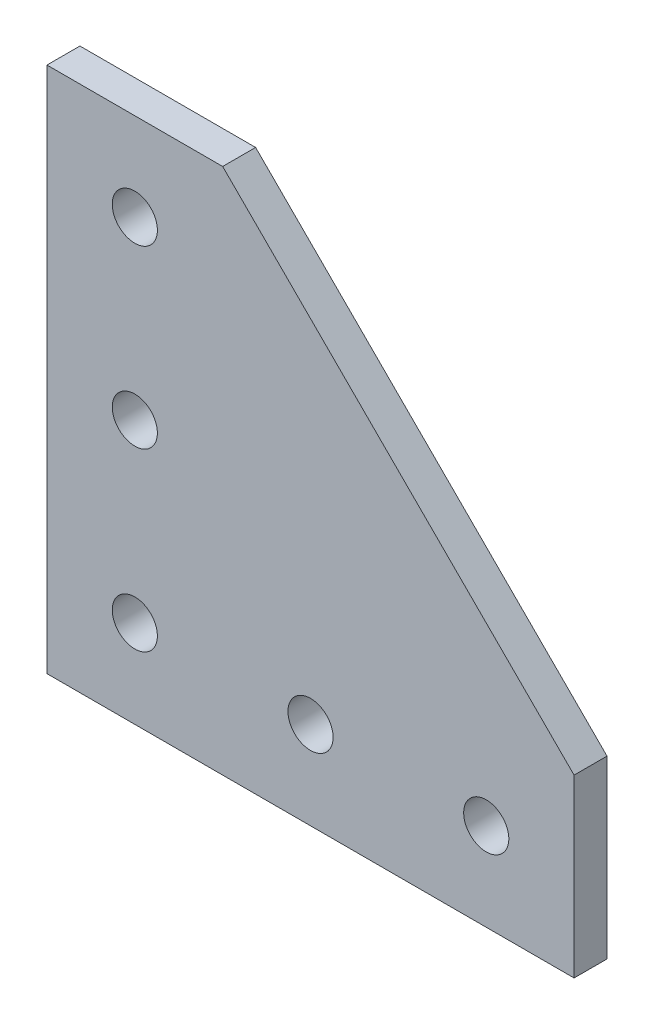
ISO-10303-21;
HEADER;
FILE_DESCRIPTION(('STEP AP214'),'2;1');
FILE_NAME('part.step','',(''),(''),'','','');
FILE_SCHEMA(('AUTOMOTIVE_DESIGN { 1 0 10303 214 1 1 1 1 }'));
ENDSEC;
DATA;
#1=APPLICATION_CONTEXT('core data for automotive mechanical design processes');
#2=APPLICATION_PROTOCOL_DEFINITION('international standard','automotive_design',2000,#1);
#3=PRODUCT_CONTEXT('',#1,'mechanical');
#4=PRODUCT('Part','Part','',(#3));
#5=PRODUCT_RELATED_PRODUCT_CATEGORY('part','',(#4));
#6=PRODUCT_DEFINITION_FORMATION('','',#4);
#7=PRODUCT_DEFINITION_CONTEXT('part definition',#1,'design');
#8=PRODUCT_DEFINITION('design','',#6,#7);
#9=PRODUCT_DEFINITION_SHAPE('','',#8);
#10=(LENGTH_UNIT() NAMED_UNIT(*) SI_UNIT(.MILLI.,.METRE.));
#11=(NAMED_UNIT(*) PLANE_ANGLE_UNIT() SI_UNIT($,.RADIAN.));
#12=(NAMED_UNIT(*) SI_UNIT($,.STERADIAN.) SOLID_ANGLE_UNIT());
#13=UNCERTAINTY_MEASURE_WITH_UNIT(LENGTH_MEASURE(1.E-05),#10,'distance_accuracy_value','');
#14=(GEOMETRIC_REPRESENTATION_CONTEXT(3) GLOBAL_UNCERTAINTY_ASSIGNED_CONTEXT((#13)) GLOBAL_UNIT_ASSIGNED_CONTEXT((#10,
#11,#12)) REPRESENTATION_CONTEXT('',''));
#15=CARTESIAN_POINT('',(0.,0.,0.));
#16=DIRECTION('',(0.,0.,1.));
#17=DIRECTION('',(1.,0.,0.));
#18=AXIS2_PLACEMENT_3D('',#15,#16,#17);
#19=CARTESIAN_POINT('',(0.,0.,-2.38125));
#20=DIRECTION('',(0.,0.,-1.));
#21=DIRECTION('',(-1.,0.,0.));
#22=AXIS2_PLACEMENT_3D('',#19,#20,#21);
#23=PLANE('',#22);
#24=CARTESIAN_POINT('',(12.7,38.1,-2.38125));
#25=DIRECTION('',(0.,0.,-1.));
#26=DIRECTION('',(-1.,0.,0.));
#27=AXIS2_PLACEMENT_3D('',#24,#25,#26);
#28=CIRCLE('',#27,3.26389999999999);
#29=CARTESIAN_POINT('',(9.43610000000001,38.1,-2.38125));
#30=VERTEX_POINT('',#29);
#31=EDGE_CURVE('E124',#30,#30,#28,.F.);
#32=ORIENTED_EDGE('',*,*,#31,.T.);
#33=EDGE_LOOP('',(#32));
#34=FACE_BOUND('',#33,.T.);
#35=CARTESIAN_POINT('',(63.5,12.7,-2.38125));
#36=DIRECTION('',(0.,0.,-1.));
#37=DIRECTION('',(-1.,0.,0.));
#38=AXIS2_PLACEMENT_3D('',#35,#36,#37);
#39=CIRCLE('',#38,3.26389999999999);
#40=CARTESIAN_POINT('',(60.2361,12.7,-2.38125));
#41=VERTEX_POINT('',#40);
#42=EDGE_CURVE('E128',#41,#41,#39,.F.);
#43=ORIENTED_EDGE('',*,*,#42,.T.);
#44=EDGE_LOOP('',(#43));
#45=FACE_BOUND('',#44,.T.);
#46=CARTESIAN_POINT('',(12.7,12.7,-2.38125));
#47=DIRECTION('',(0.,0.,-1.));
#48=DIRECTION('',(-1.,0.,0.));
#49=AXIS2_PLACEMENT_3D('',#46,#47,#48);
#50=CIRCLE('',#49,3.2639);
#51=CARTESIAN_POINT('',(9.4361,12.7,-2.38125));
#52=VERTEX_POINT('',#51);
#53=EDGE_CURVE('E132',#52,#52,#50,.F.);
#54=ORIENTED_EDGE('',*,*,#53,.T.);
#55=EDGE_LOOP('',(#54));
#56=FACE_BOUND('',#55,.T.);
#57=DIRECTION('',(0.707106781186548,-0.707106781186548,0.));
#58=VECTOR('',#57,1.);
#59=CARTESIAN_POINT('',(76.2,25.4,-2.38125));
#60=LINE('',#59,#58);
#61=CARTESIAN_POINT('',(25.4,76.2,-2.38125));
#62=VERTEX_POINT('',#61);
#63=CARTESIAN_POINT('',(76.2,25.4,-2.38125));
#64=VERTEX_POINT('',#63);
#65=EDGE_CURVE('E341',#62,#64,#60,.T.);
#66=ORIENTED_EDGE('',*,*,#65,.T.);
#67=DIRECTION('',(0.,1.,0.));
#68=VECTOR('',#67,1.);
#69=CARTESIAN_POINT('',(76.2,25.4,-2.38125));
#70=LINE('',#69,#68);
#71=CARTESIAN_POINT('',(76.2,0.,-2.38125));
#72=VERTEX_POINT('',#71);
#73=EDGE_CURVE('E336',#64,#72,#70,.F.);
#74=ORIENTED_EDGE('',*,*,#73,.T.);
#75=DIRECTION('',(-1.,0.,0.));
#76=VECTOR('',#75,1.);
#77=CARTESIAN_POINT('',(76.2,0.,-2.38125));
#78=LINE('',#77,#76);
#79=CARTESIAN_POINT('',(0.,0.,-2.38125));
#80=VERTEX_POINT('',#79);
#81=EDGE_CURVE('E80',#72,#80,#78,.T.);
#82=ORIENTED_EDGE('',*,*,#81,.T.);
#83=DIRECTION('',(0.,1.,0.));
#84=VECTOR('',#83,1.);
#85=CARTESIAN_POINT('',(0.,0.,-2.38125));
#86=LINE('',#85,#84);
#87=CARTESIAN_POINT('',(0.,76.2,-2.38125));
#88=VERTEX_POINT('',#87);
#89=EDGE_CURVE('E78',#80,#88,#86,.T.);
#90=ORIENTED_EDGE('',*,*,#89,.T.);
#91=DIRECTION('',(1.,0.,0.));
#92=VECTOR('',#91,1.);
#93=CARTESIAN_POINT('',(0.,76.2,-2.38125));
#94=LINE('',#93,#92);
#95=EDGE_CURVE('E75',#88,#62,#94,.T.);
#96=ORIENTED_EDGE('',*,*,#95,.T.);
#97=EDGE_LOOP('',(#66,#74,#82,#90,#96));
#98=FACE_BOUND('',#97,.T.);
#99=CARTESIAN_POINT('',(38.1,12.7,-2.38125));
#100=DIRECTION('',(0.,0.,-1.));
#101=DIRECTION('',(-1.,0.,0.));
#102=AXIS2_PLACEMENT_3D('',#99,#100,#101);
#103=CIRCLE('',#102,3.26389999999999);
#104=CARTESIAN_POINT('',(34.8361,12.7,-2.38125));
#105=VERTEX_POINT('',#104);
#106=EDGE_CURVE('E87',#105,#105,#103,.F.);
#107=ORIENTED_EDGE('',*,*,#106,.T.);
#108=EDGE_LOOP('',(#107));
#109=FACE_BOUND('',#108,.T.);
#110=CARTESIAN_POINT('',(12.7,63.5,-2.38125));
#111=DIRECTION('',(0.,0.,-1.));
#112=DIRECTION('',(-1.,0.,0.));
#113=AXIS2_PLACEMENT_3D('',#110,#111,#112);
#114=CIRCLE('',#113,3.2639);
#115=CARTESIAN_POINT('',(9.4361,63.5,-2.38125));
#116=VERTEX_POINT('',#115);
#117=EDGE_CURVE('E21',#116,#116,#114,.F.);
#118=ORIENTED_EDGE('',*,*,#117,.T.);
#119=EDGE_LOOP('',(#118));
#120=FACE_BOUND('',#119,.T.);
#121=ADVANCED_FACE('F18',(#34,#45,#56,#98,#109,#120),#23,.T.);
#122=CARTESIAN_POINT('',(12.7,63.5,2.38125));
#123=DIRECTION('',(0.,0.,-1.));
#124=DIRECTION('',(-1.,0.,0.));
#125=AXIS2_PLACEMENT_3D('',#122,#123,#124);
#126=CYLINDRICAL_SURFACE('',#125,3.2639);
#127=ORIENTED_EDGE('',*,*,#117,.F.);
#128=EDGE_LOOP('',(#127));
#129=FACE_BOUND('',#128,.T.);
#130=CARTESIAN_POINT('',(12.7,63.5,2.38125));
#131=DIRECTION('',(0.,0.,-1.));
#132=DIRECTION('',(-1.,0.,0.));
#133=AXIS2_PLACEMENT_3D('',#130,#131,#132);
#134=CIRCLE('',#133,3.2639);
#135=CARTESIAN_POINT('',(9.4361,63.5,2.38125));
#136=VERTEX_POINT('',#135);
#137=EDGE_CURVE('E120',#136,#136,#134,.F.);
#138=ORIENTED_EDGE('',*,*,#137,.T.);
#139=EDGE_LOOP('',(#138));
#140=FACE_BOUND('',#139,.T.);
#141=ADVANCED_FACE('F144',(#129,#140),#126,.F.);
#142=CARTESIAN_POINT('',(38.1,12.7,2.38125));
#143=DIRECTION('',(0.,0.,-1.));
#144=DIRECTION('',(-1.,0.,0.));
#145=AXIS2_PLACEMENT_3D('',#142,#143,#144);
#146=CYLINDRICAL_SURFACE('',#145,3.26389999999999);
#147=ORIENTED_EDGE('',*,*,#106,.F.);
#148=EDGE_LOOP('',(#147));
#149=FACE_BOUND('',#148,.T.);
#150=CARTESIAN_POINT('',(38.1,12.7,2.38125));
#151=DIRECTION('',(0.,0.,-1.));
#152=DIRECTION('',(-1.,0.,0.));
#153=AXIS2_PLACEMENT_3D('',#150,#151,#152);
#154=CIRCLE('',#153,3.26389999999999);
#155=CARTESIAN_POINT('',(34.8361,12.7,2.38125));
#156=VERTEX_POINT('',#155);
#157=EDGE_CURVE('E116',#156,#156,#154,.F.);
#158=ORIENTED_EDGE('',*,*,#157,.T.);
#159=EDGE_LOOP('',(#158));
#160=FACE_BOUND('',#159,.T.);
#161=ADVANCED_FACE('F147',(#149,#160),#146,.F.);
#162=CARTESIAN_POINT('',(0.,0.,2.38125));
#163=DIRECTION('',(1.,0.,0.));
#164=DIRECTION('',(0.,0.,-1.));
#165=AXIS2_PLACEMENT_3D('',#162,#163,#164);
#166=PLANE('',#165);
#167=DIRECTION('',(0.,0.,1.));
#168=VECTOR('',#167,1.);
#169=CARTESIAN_POINT('',(0.,0.,2.38125));
#170=LINE('',#169,#168);
#171=CARTESIAN_POINT('',(0.,0.,2.38125));
#172=VERTEX_POINT('',#171);
#173=EDGE_CURVE('E333',#80,#172,#170,.T.);
#174=ORIENTED_EDGE('',*,*,#173,.T.);
#175=DIRECTION('',(0.,1.,0.));
#176=VECTOR('',#175,1.);
#177=CARTESIAN_POINT('',(0.,0.,2.38125));
#178=LINE('',#177,#176);
#179=CARTESIAN_POINT('',(0.,76.2,2.38125));
#180=VERTEX_POINT('',#179);
#181=EDGE_CURVE('E99',#172,#180,#178,.T.);
#182=ORIENTED_EDGE('',*,*,#181,.T.);
#183=DIRECTION('',(0.,0.,-1.));
#184=VECTOR('',#183,1.);
#185=CARTESIAN_POINT('',(0.,76.2,2.38125));
#186=LINE('',#185,#184);
#187=EDGE_CURVE('E86',#180,#88,#186,.T.);
#188=ORIENTED_EDGE('',*,*,#187,.T.);
#189=ORIENTED_EDGE('',*,*,#89,.F.);
#190=EDGE_LOOP('',(#174,#182,#188,#189));
#191=FACE_BOUND('',#190,.T.);
#192=ADVANCED_FACE('F98',(#191),#166,.F.);
#193=CARTESIAN_POINT('',(0.,76.2,2.38125));
#194=DIRECTION('',(0.,-1.,0.));
#195=DIRECTION('',(0.,0.,-1.));
#196=AXIS2_PLACEMENT_3D('',#193,#194,#195);
#197=PLANE('',#196);
#198=ORIENTED_EDGE('',*,*,#187,.F.);
#199=DIRECTION('',(-1.,0.,0.));
#200=VECTOR('',#199,1.);
#201=CARTESIAN_POINT('',(0.,76.2,2.38125));
#202=LINE('',#201,#200);
#203=CARTESIAN_POINT('',(25.4,76.2,2.38125));
#204=VERTEX_POINT('',#203);
#205=EDGE_CURVE('E320',#180,#204,#202,.F.);
#206=ORIENTED_EDGE('',*,*,#205,.T.);
#207=DIRECTION('',(0.,0.,1.));
#208=VECTOR('',#207,1.);
#209=CARTESIAN_POINT('',(25.4,76.2,2.38125));
#210=LINE('',#209,#208);
#211=EDGE_CURVE('E94',#204,#62,#210,.F.);
#212=ORIENTED_EDGE('',*,*,#211,.T.);
#213=ORIENTED_EDGE('',*,*,#95,.F.);
#214=EDGE_LOOP('',(#198,#206,#212,#213));
#215=FACE_BOUND('',#214,.T.);
#216=ADVANCED_FACE('F91',(#215),#197,.F.);
#217=CARTESIAN_POINT('',(76.2,25.4,2.38125));
#218=DIRECTION('',(-0.707106781186548,-0.707106781186548,0.));
#219=DIRECTION('',(0.707106781186548,-0.707106781186548,0.));
#220=AXIS2_PLACEMENT_3D('',#217,#218,#219);
#221=PLANE('',#220);
#222=ORIENTED_EDGE('',*,*,#211,.F.);
#223=DIRECTION('',(0.707106781186547,-0.707106781186547,0.));
#224=VECTOR('',#223,1.);
#225=CARTESIAN_POINT('',(25.4,76.2,2.38125));
#226=LINE('',#225,#224);
#227=CARTESIAN_POINT('',(76.2,25.4,2.38125));
#228=VERTEX_POINT('',#227);
#229=EDGE_CURVE('E314',#204,#228,#226,.T.);
#230=ORIENTED_EDGE('',*,*,#229,.T.);
#231=DIRECTION('',(0.,0.,1.));
#232=VECTOR('',#231,1.);
#233=CARTESIAN_POINT('',(76.2,25.4,2.38125));
#234=LINE('',#233,#232);
#235=EDGE_CURVE('E318',#228,#64,#234,.F.);
#236=ORIENTED_EDGE('',*,*,#235,.T.);
#237=ORIENTED_EDGE('',*,*,#65,.F.);
#238=EDGE_LOOP('',(#222,#230,#236,#237));
#239=FACE_BOUND('',#238,.T.);
#240=ADVANCED_FACE('F178',(#239),#221,.F.);
#241=CARTESIAN_POINT('',(76.2,25.4,2.38125));
#242=DIRECTION('',(-1.,0.,0.));
#243=DIRECTION('',(0.,0.,1.));
#244=AXIS2_PLACEMENT_3D('',#241,#242,#243);
#245=PLANE('',#244);
#246=ORIENTED_EDGE('',*,*,#235,.F.);
#247=DIRECTION('',(0.,1.,0.));
#248=VECTOR('',#247,1.);
#249=CARTESIAN_POINT('',(76.2,0.,2.38125));
#250=LINE('',#249,#248);
#251=CARTESIAN_POINT('',(76.2,0.,2.38125));
#252=VERTEX_POINT('',#251);
#253=EDGE_CURVE('E312',#228,#252,#250,.F.);
#254=ORIENTED_EDGE('',*,*,#253,.T.);
#255=DIRECTION('',(0.,0.,1.));
#256=VECTOR('',#255,1.);
#257=CARTESIAN_POINT('',(76.2,0.,2.38125));
#258=LINE('',#257,#256);
#259=EDGE_CURVE('E41',#252,#72,#258,.F.);
#260=ORIENTED_EDGE('',*,*,#259,.T.);
#261=ORIENTED_EDGE('',*,*,#73,.F.);
#262=EDGE_LOOP('',(#246,#254,#260,#261));
#263=FACE_BOUND('',#262,.T.);
#264=ADVANCED_FACE('F175',(#263),#245,.F.);
#265=CARTESIAN_POINT('',(76.2,0.,2.38125));
#266=DIRECTION('',(0.,1.,0.));
#267=DIRECTION('',(-1.,0.,0.));
#268=AXIS2_PLACEMENT_3D('',#265,#266,#267);
#269=PLANE('',#268);
#270=ORIENTED_EDGE('',*,*,#259,.F.);
#271=DIRECTION('',(-1.,0.,0.));
#272=VECTOR('',#271,1.);
#273=CARTESIAN_POINT('',(0.,0.,2.38125));
#274=LINE('',#273,#272);
#275=EDGE_CURVE('E115',#252,#172,#274,.T.);
#276=ORIENTED_EDGE('',*,*,#275,.T.);
#277=ORIENTED_EDGE('',*,*,#173,.F.);
#278=ORIENTED_EDGE('',*,*,#81,.F.);
#279=EDGE_LOOP('',(#270,#276,#277,#278));
#280=FACE_BOUND('',#279,.T.);
#281=ADVANCED_FACE('F171',(#280),#269,.F.);
#282=CARTESIAN_POINT('',(12.7,12.7,2.38125));
#283=DIRECTION('',(0.,0.,-1.));
#284=DIRECTION('',(-1.,0.,0.));
#285=AXIS2_PLACEMENT_3D('',#282,#283,#284);
#286=CYLINDRICAL_SURFACE('',#285,3.2639);
#287=ORIENTED_EDGE('',*,*,#53,.F.);
#288=EDGE_LOOP('',(#287));
#289=FACE_BOUND('',#288,.T.);
#290=CARTESIAN_POINT('',(12.7,12.7,2.38125));
#291=DIRECTION('',(0.,0.,-1.));
#292=DIRECTION('',(-1.,0.,0.));
#293=AXIS2_PLACEMENT_3D('',#290,#291,#292);
#294=CIRCLE('',#293,3.2639);
#295=CARTESIAN_POINT('',(9.4361,12.7,2.38125));
#296=VERTEX_POINT('',#295);
#297=EDGE_CURVE('E111',#296,#296,#294,.F.);
#298=ORIENTED_EDGE('',*,*,#297,.T.);
#299=EDGE_LOOP('',(#298));
#300=FACE_BOUND('',#299,.T.);
#301=ADVANCED_FACE('F167',(#289,#300),#286,.F.);
#302=CARTESIAN_POINT('',(63.5,12.7,2.38125));
#303=DIRECTION('',(0.,0.,-1.));
#304=DIRECTION('',(-1.,0.,0.));
#305=AXIS2_PLACEMENT_3D('',#302,#303,#304);
#306=CYLINDRICAL_SURFACE('',#305,3.26389999999999);
#307=ORIENTED_EDGE('',*,*,#42,.F.);
#308=EDGE_LOOP('',(#307));
#309=FACE_BOUND('',#308,.T.);
#310=CARTESIAN_POINT('',(63.5,12.7,2.38125));
#311=DIRECTION('',(0.,0.,-1.));
#312=DIRECTION('',(-1.,0.,0.));
#313=AXIS2_PLACEMENT_3D('',#310,#311,#312);
#314=CIRCLE('',#313,3.26389999999999);
#315=CARTESIAN_POINT('',(60.2361,12.7,2.38125));
#316=VERTEX_POINT('',#315);
#317=EDGE_CURVE('E28',#316,#316,#314,.F.);
#318=ORIENTED_EDGE('',*,*,#317,.T.);
#319=EDGE_LOOP('',(#318));
#320=FACE_BOUND('',#319,.T.);
#321=ADVANCED_FACE('F159',(#309,#320),#306,.F.);
#322=CARTESIAN_POINT('',(12.7,38.1,2.38125));
#323=DIRECTION('',(0.,0.,-1.));
#324=DIRECTION('',(-1.,0.,0.));
#325=AXIS2_PLACEMENT_3D('',#322,#323,#324);
#326=CYLINDRICAL_SURFACE('',#325,3.26389999999999);
#327=ORIENTED_EDGE('',*,*,#31,.F.);
#328=EDGE_LOOP('',(#327));
#329=FACE_BOUND('',#328,.T.);
#330=CARTESIAN_POINT('',(12.7,38.1,2.38125));
#331=DIRECTION('',(0.,0.,-1.));
#332=DIRECTION('',(-1.,0.,0.));
#333=AXIS2_PLACEMENT_3D('',#330,#331,#332);
#334=CIRCLE('',#333,3.26389999999999);
#335=CARTESIAN_POINT('',(9.43610000000001,38.1,2.38125));
#336=VERTEX_POINT('',#335);
#337=EDGE_CURVE('E11',#336,#336,#334,.F.);
#338=ORIENTED_EDGE('',*,*,#337,.T.);
#339=EDGE_LOOP('',(#338));
#340=FACE_BOUND('',#339,.T.);
#341=ADVANCED_FACE('F152',(#329,#340),#326,.F.);
#342=CARTESIAN_POINT('',(0.,0.,2.38125));
#343=DIRECTION('',(0.,0.,-1.));
#344=DIRECTION('',(-1.,0.,0.));
#345=AXIS2_PLACEMENT_3D('',#342,#343,#344);
#346=PLANE('',#345);
#347=ORIENTED_EDGE('',*,*,#337,.F.);
#348=EDGE_LOOP('',(#347));
#349=FACE_BOUND('',#348,.T.);
#350=ORIENTED_EDGE('',*,*,#317,.F.);
#351=EDGE_LOOP('',(#350));
#352=FACE_BOUND('',#351,.T.);
#353=ORIENTED_EDGE('',*,*,#297,.F.);
#354=EDGE_LOOP('',(#353));
#355=FACE_BOUND('',#354,.T.);
#356=ORIENTED_EDGE('',*,*,#253,.F.);
#357=ORIENTED_EDGE('',*,*,#229,.F.);
#358=ORIENTED_EDGE('',*,*,#205,.F.);
#359=ORIENTED_EDGE('',*,*,#181,.F.);
#360=ORIENTED_EDGE('',*,*,#275,.F.);
#361=EDGE_LOOP('',(#356,#357,#358,#359,#360));
#362=FACE_BOUND('',#361,.T.);
#363=ORIENTED_EDGE('',*,*,#157,.F.);
#364=EDGE_LOOP('',(#363));
#365=FACE_BOUND('',#364,.T.);
#366=ORIENTED_EDGE('',*,*,#137,.F.);
#367=EDGE_LOOP('',(#366));
#368=FACE_BOUND('',#367,.T.);
#369=ADVANCED_FACE('F150',(#349,#352,#355,#362,#365,#368),#346,.F.);
#370=CLOSED_SHELL('',(#121,#141,#161,#192,#216,#240,#264,#281,#301,#321,#341,#369));
#371=MANIFOLD_SOLID_BREP('B1',#370);
#372=ADVANCED_BREP_SHAPE_REPRESENTATION('',(#18,#371),#14);
#373=SHAPE_DEFINITION_REPRESENTATION(#9,#372);
ENDSEC;
END-ISO-10303-21;
